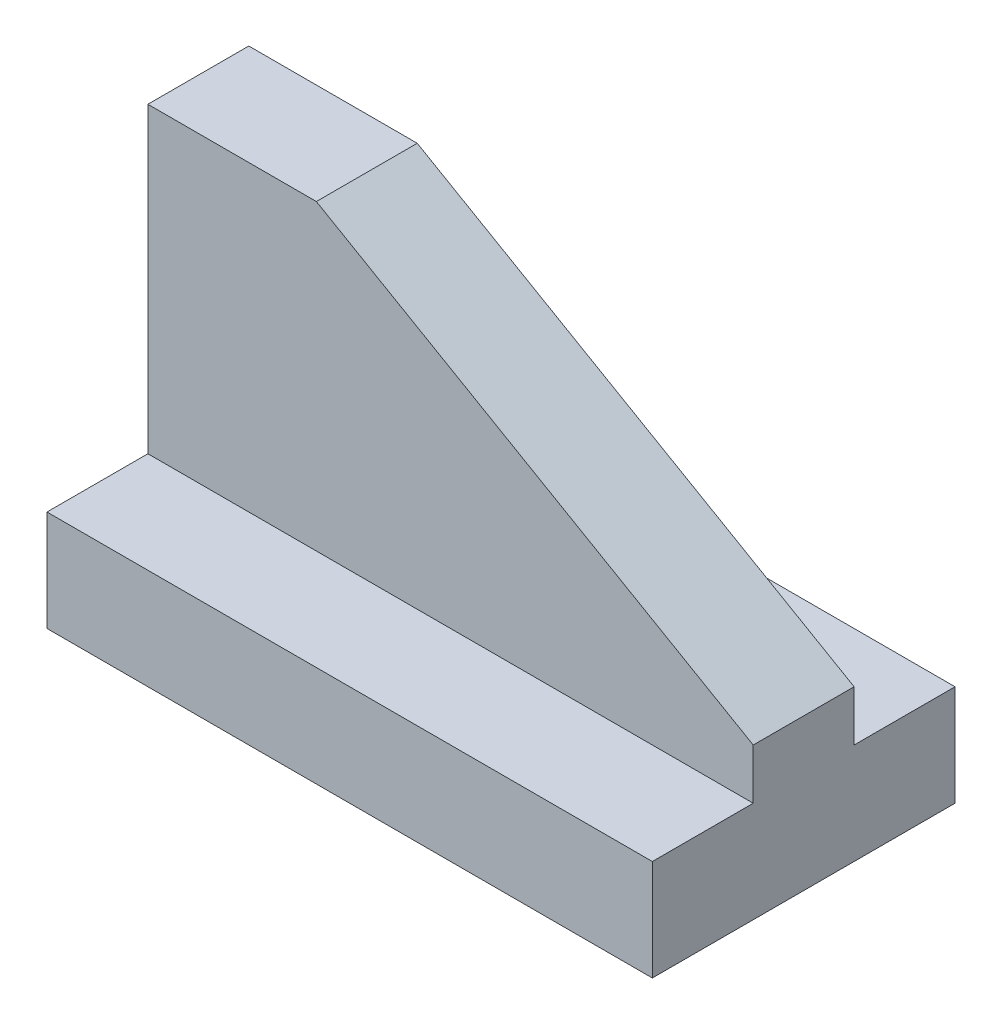
ISO-10303-21;
HEADER;
FILE_DESCRIPTION(('STEP AP214'),'2;1');
FILE_NAME('part.step','',(''),(''),'','','');
FILE_SCHEMA(('AUTOMOTIVE_DESIGN { 1 0 10303 214 1 1 1 1 }'));
ENDSEC;
DATA;
#1=APPLICATION_CONTEXT('core data for automotive mechanical design processes');
#2=APPLICATION_PROTOCOL_DEFINITION('international standard','automotive_design',2000,#1);
#3=PRODUCT_CONTEXT('',#1,'mechanical');
#4=PRODUCT('Part','Part','',(#3));
#5=PRODUCT_RELATED_PRODUCT_CATEGORY('part','',(#4));
#6=PRODUCT_DEFINITION_FORMATION('','',#4);
#7=PRODUCT_DEFINITION_CONTEXT('part definition',#1,'design');
#8=PRODUCT_DEFINITION('design','',#6,#7);
#9=PRODUCT_DEFINITION_SHAPE('','',#8);
#10=(LENGTH_UNIT() NAMED_UNIT(*) SI_UNIT(.MILLI.,.METRE.));
#11=(NAMED_UNIT(*) PLANE_ANGLE_UNIT() SI_UNIT($,.RADIAN.));
#12=(NAMED_UNIT(*) SI_UNIT($,.STERADIAN.) SOLID_ANGLE_UNIT());
#13=UNCERTAINTY_MEASURE_WITH_UNIT(LENGTH_MEASURE(1.E-05),#10,'distance_accuracy_value','');
#14=(GEOMETRIC_REPRESENTATION_CONTEXT(3) GLOBAL_UNCERTAINTY_ASSIGNED_CONTEXT((#13)) GLOBAL_UNIT_ASSIGNED_CONTEXT((#10,
#11,#12)) REPRESENTATION_CONTEXT('',''));
#15=CARTESIAN_POINT('',(0.,0.,0.));
#16=DIRECTION('',(0.,0.,1.));
#17=DIRECTION('',(1.,0.,0.));
#18=AXIS2_PLACEMENT_3D('',#15,#16,#17);
#19=CARTESIAN_POINT('',(0.,20.,60.));
#20=DIRECTION('',(0.,-1.,0.));
#21=DIRECTION('',(0.,0.,-1.));
#22=AXIS2_PLACEMENT_3D('',#19,#20,#21);
#23=PLANE('',#22);
#24=DIRECTION('',(1.,0.,0.));
#25=VECTOR('',#24,1.);
#26=CARTESIAN_POINT('',(120.,20.,40.));
#27=LINE('',#26,#25);
#28=CARTESIAN_POINT('',(0.,20.,40.));
#29=VERTEX_POINT('',#28);
#30=CARTESIAN_POINT('',(120.,20.,40.));
#31=VERTEX_POINT('',#30);
#32=EDGE_CURVE('E111',#29,#31,#27,.T.);
#33=ORIENTED_EDGE('',*,*,#32,.F.);
#34=DIRECTION('',(0.,0.,-1.));
#35=VECTOR('',#34,1.);
#36=CARTESIAN_POINT('',(0.,20.,60.));
#37=LINE('',#36,#35);
#38=CARTESIAN_POINT('',(0.,20.,60.));
#39=VERTEX_POINT('',#38);
#40=EDGE_CURVE('E193',#39,#29,#37,.T.);
#41=ORIENTED_EDGE('',*,*,#40,.F.);
#42=DIRECTION('',(-1.,0.,0.));
#43=VECTOR('',#42,1.);
#44=CARTESIAN_POINT('',(0.,20.,60.));
#45=LINE('',#44,#43);
#46=CARTESIAN_POINT('',(120.,20.,60.));
#47=VERTEX_POINT('',#46);
#48=EDGE_CURVE('E113',#47,#39,#45,.T.);
#49=ORIENTED_EDGE('',*,*,#48,.F.);
#50=DIRECTION('',(0.,0.,-1.));
#51=VECTOR('',#50,1.);
#52=CARTESIAN_POINT('',(120.,20.,60.));
#53=LINE('',#52,#51);
#54=EDGE_CURVE('E107',#47,#31,#53,.T.);
#55=ORIENTED_EDGE('',*,*,#54,.T.);
#56=EDGE_LOOP('',(#33,#41,#49,#55));
#57=FACE_BOUND('',#56,.T.);
#58=ADVANCED_FACE('F35',(#57),#23,.F.);
#59=CARTESIAN_POINT('',(0.,0.,60.));
#60=DIRECTION('',(1.,0.,0.));
#61=DIRECTION('',(0.,0.,-1.));
#62=AXIS2_PLACEMENT_3D('',#59,#60,#61);
#63=PLANE('',#62);
#64=DIRECTION('',(0.,-1.,0.));
#65=VECTOR('',#64,1.);
#66=CARTESIAN_POINT('',(0.,0.,0.));
#67=LINE('',#66,#65);
#68=CARTESIAN_POINT('',(0.,20.,0.));
#69=VERTEX_POINT('',#68);
#70=CARTESIAN_POINT('',(0.,0.,0.));
#71=VERTEX_POINT('',#70);
#72=EDGE_CURVE('E169',#69,#71,#67,.T.);
#73=ORIENTED_EDGE('',*,*,#72,.T.);
#74=DIRECTION('',(0.,0.,-1.));
#75=VECTOR('',#74,1.);
#76=CARTESIAN_POINT('',(0.,0.,60.));
#77=LINE('',#76,#75);
#78=CARTESIAN_POINT('',(0.,0.,60.));
#79=VERTEX_POINT('',#78);
#80=EDGE_CURVE('E11',#79,#71,#77,.T.);
#81=ORIENTED_EDGE('',*,*,#80,.F.);
#82=DIRECTION('',(0.,-1.,0.));
#83=VECTOR('',#82,1.);
#84=CARTESIAN_POINT('',(0.,0.,60.));
#85=LINE('',#84,#83);
#86=EDGE_CURVE('E170',#39,#79,#85,.T.);
#87=ORIENTED_EDGE('',*,*,#86,.F.);
#88=ORIENTED_EDGE('',*,*,#40,.T.);
#89=DIRECTION('',(0.,-1.,0.));
#90=VECTOR('',#89,1.);
#91=CARTESIAN_POINT('',(0.,20.,40.));
#92=LINE('',#91,#90);
#93=CARTESIAN_POINT('',(0.,80.,40.));
#94=VERTEX_POINT('',#93);
#95=EDGE_CURVE('E131',#94,#29,#92,.T.);
#96=ORIENTED_EDGE('',*,*,#95,.F.);
#97=DIRECTION('',(0.,0.,-1.));
#98=VECTOR('',#97,1.);
#99=CARTESIAN_POINT('',(0.,80.,40.));
#100=LINE('',#99,#98);
#101=CARTESIAN_POINT('',(0.,80.,20.));
#102=VERTEX_POINT('',#101);
#103=EDGE_CURVE('E164',#94,#102,#100,.T.);
#104=ORIENTED_EDGE('',*,*,#103,.T.);
#105=DIRECTION('',(0.,-1.,0.));
#106=VECTOR('',#105,1.);
#107=CARTESIAN_POINT('',(0.,20.,20.));
#108=LINE('',#107,#106);
#109=CARTESIAN_POINT('',(0.,20.,20.));
#110=VERTEX_POINT('',#109);
#111=EDGE_CURVE('E132',#102,#110,#108,.T.);
#112=ORIENTED_EDGE('',*,*,#111,.T.);
#113=EDGE_CURVE('E57',#110,#69,#37,.T.);
#114=ORIENTED_EDGE('',*,*,#113,.T.);
#115=EDGE_LOOP('',(#73,#81,#87,#88,#96,#104,#112,#114));
#116=FACE_BOUND('',#115,.T.);
#117=ADVANCED_FACE('F37',(#116),#63,.F.);
#118=CARTESIAN_POINT('',(0.,0.,60.));
#119=DIRECTION('',(0.,1.,0.));
#120=DIRECTION('',(0.,0.,1.));
#121=AXIS2_PLACEMENT_3D('',#118,#119,#120);
#122=PLANE('',#121);
#123=DIRECTION('',(1.,0.,0.));
#124=VECTOR('',#123,1.);
#125=CARTESIAN_POINT('',(0.,0.,0.));
#126=LINE('',#125,#124);
#127=CARTESIAN_POINT('',(120.,0.,0.));
#128=VERTEX_POINT('',#127);
#129=EDGE_CURVE('E181',#71,#128,#126,.T.);
#130=ORIENTED_EDGE('',*,*,#129,.T.);
#131=DIRECTION('',(0.,0.,-1.));
#132=VECTOR('',#131,1.);
#133=CARTESIAN_POINT('',(120.,0.,60.));
#134=LINE('',#133,#132);
#135=CARTESIAN_POINT('',(120.,0.,60.));
#136=VERTEX_POINT('',#135);
#137=EDGE_CURVE('E44',#136,#128,#134,.T.);
#138=ORIENTED_EDGE('',*,*,#137,.F.);
#139=DIRECTION('',(1.,0.,0.));
#140=VECTOR('',#139,1.);
#141=CARTESIAN_POINT('',(0.,0.,60.));
#142=LINE('',#141,#140);
#143=EDGE_CURVE('E173',#79,#136,#142,.T.);
#144=ORIENTED_EDGE('',*,*,#143,.F.);
#145=ORIENTED_EDGE('',*,*,#80,.T.);
#146=EDGE_LOOP('',(#130,#138,#144,#145));
#147=FACE_BOUND('',#146,.T.);
#148=ADVANCED_FACE('F226',(#147),#122,.F.);
#149=CARTESIAN_POINT('',(120.,0.,60.));
#150=DIRECTION('',(-1.,0.,0.));
#151=DIRECTION('',(0.,0.,1.));
#152=AXIS2_PLACEMENT_3D('',#149,#150,#151);
#153=PLANE('',#152);
#154=DIRECTION('',(0.,1.,0.));
#155=VECTOR('',#154,1.);
#156=CARTESIAN_POINT('',(120.,0.,0.));
#157=LINE('',#156,#155);
#158=CARTESIAN_POINT('',(120.,20.,0.));
#159=VERTEX_POINT('',#158);
#160=EDGE_CURVE('E183',#128,#159,#157,.T.);
#161=ORIENTED_EDGE('',*,*,#160,.T.);
#162=CARTESIAN_POINT('',(120.,20.,20.));
#163=VERTEX_POINT('',#162);
#164=EDGE_CURVE('E116',#163,#159,#53,.T.);
#165=ORIENTED_EDGE('',*,*,#164,.F.);
#166=DIRECTION('',(0.,1.,0.));
#167=VECTOR('',#166,1.);
#168=CARTESIAN_POINT('',(120.,30.,20.));
#169=LINE('',#168,#167);
#170=CARTESIAN_POINT('',(120.,30.,20.));
#171=VERTEX_POINT('',#170);
#172=EDGE_CURVE('E152',#163,#171,#169,.T.);
#173=ORIENTED_EDGE('',*,*,#172,.T.);
#174=DIRECTION('',(0.,0.,-1.));
#175=VECTOR('',#174,1.);
#176=CARTESIAN_POINT('',(120.,30.,40.));
#177=LINE('',#176,#175);
#178=CARTESIAN_POINT('',(120.,30.,40.));
#179=VERTEX_POINT('',#178);
#180=EDGE_CURVE('E123',#179,#171,#177,.T.);
#181=ORIENTED_EDGE('',*,*,#180,.F.);
#182=DIRECTION('',(0.,1.,0.));
#183=VECTOR('',#182,1.);
#184=CARTESIAN_POINT('',(120.,30.,40.));
#185=LINE('',#184,#183);
#186=EDGE_CURVE('E119',#31,#179,#185,.T.);
#187=ORIENTED_EDGE('',*,*,#186,.F.);
#188=ORIENTED_EDGE('',*,*,#54,.F.);
#189=DIRECTION('',(0.,1.,0.));
#190=VECTOR('',#189,1.);
#191=CARTESIAN_POINT('',(120.,0.,60.));
#192=LINE('',#191,#190);
#193=EDGE_CURVE('E176',#136,#47,#192,.T.);
#194=ORIENTED_EDGE('',*,*,#193,.F.);
#195=ORIENTED_EDGE('',*,*,#137,.T.);
#196=EDGE_LOOP('',(#161,#165,#173,#181,#187,#188,#194,#195));
#197=FACE_BOUND('',#196,.T.);
#198=ADVANCED_FACE('F121',(#197),#153,.F.);
#199=ORIENTED_EDGE('',*,*,#113,.F.);
#200=DIRECTION('',(1.,0.,0.));
#201=VECTOR('',#200,1.);
#202=CARTESIAN_POINT('',(120.,20.,20.));
#203=LINE('',#202,#201);
#204=EDGE_CURVE('E52',#110,#163,#203,.T.);
#205=ORIENTED_EDGE('',*,*,#204,.T.);
#206=ORIENTED_EDGE('',*,*,#164,.T.);
#207=DIRECTION('',(-1.,0.,0.));
#208=VECTOR('',#207,1.);
#209=CARTESIAN_POINT('',(0.,20.,0.));
#210=LINE('',#209,#208);
#211=EDGE_CURVE('E174',#159,#69,#210,.T.);
#212=ORIENTED_EDGE('',*,*,#211,.T.);
#213=EDGE_LOOP('',(#199,#205,#206,#212));
#214=FACE_BOUND('',#213,.T.);
#215=ADVANCED_FACE('F202',(#214),#23,.F.);
#216=CARTESIAN_POINT('',(0.,0.,60.));
#217=DIRECTION('',(0.,0.,-1.));
#218=DIRECTION('',(-1.,0.,0.));
#219=AXIS2_PLACEMENT_3D('',#216,#217,#218);
#220=PLANE('',#219);
#221=ORIENTED_EDGE('',*,*,#86,.T.);
#222=ORIENTED_EDGE('',*,*,#143,.T.);
#223=ORIENTED_EDGE('',*,*,#193,.T.);
#224=ORIENTED_EDGE('',*,*,#48,.T.);
#225=EDGE_LOOP('',(#221,#222,#223,#224));
#226=FACE_BOUND('',#225,.T.);
#227=ADVANCED_FACE('F218',(#226),#220,.F.);
#228=CARTESIAN_POINT('',(0.,0.,0.));
#229=DIRECTION('',(0.,0.,-1.));
#230=DIRECTION('',(-1.,0.,0.));
#231=AXIS2_PLACEMENT_3D('',#228,#229,#230);
#232=PLANE('',#231);
#233=ORIENTED_EDGE('',*,*,#72,.F.);
#234=ORIENTED_EDGE('',*,*,#211,.F.);
#235=ORIENTED_EDGE('',*,*,#160,.F.);
#236=ORIENTED_EDGE('',*,*,#129,.F.);
#237=EDGE_LOOP('',(#233,#234,#235,#236));
#238=FACE_BOUND('',#237,.T.);
#239=ADVANCED_FACE('F201',(#238),#232,.T.);
#240=CARTESIAN_POINT('',(33.3974596215556,80.,40.));
#241=DIRECTION('',(-0.499999999999998,-0.86602540378444,0.));
#242=DIRECTION('',(0.86602540378444,-0.499999999999998,0.));
#243=AXIS2_PLACEMENT_3D('',#240,#241,#242);
#244=PLANE('',#243);
#245=DIRECTION('',(-0.86602540378444,0.499999999999998,0.));
#246=VECTOR('',#245,1.);
#247=CARTESIAN_POINT('',(33.3974596215556,80.,20.));
#248=LINE('',#247,#246);
#249=CARTESIAN_POINT('',(33.3974596215556,80.,20.));
#250=VERTEX_POINT('',#249);
#251=EDGE_CURVE('E148',#171,#250,#248,.T.);
#252=ORIENTED_EDGE('',*,*,#251,.T.);
#253=DIRECTION('',(0.,0.,-1.));
#254=VECTOR('',#253,1.);
#255=CARTESIAN_POINT('',(33.3974596215556,80.,40.));
#256=LINE('',#255,#254);
#257=CARTESIAN_POINT('',(33.3974596215556,80.,40.));
#258=VERTEX_POINT('',#257);
#259=EDGE_CURVE('E166',#258,#250,#256,.T.);
#260=ORIENTED_EDGE('',*,*,#259,.F.);
#261=DIRECTION('',(-0.86602540378444,0.499999999999998,0.));
#262=VECTOR('',#261,1.);
#263=CARTESIAN_POINT('',(33.3974596215556,80.,40.));
#264=LINE('',#263,#262);
#265=EDGE_CURVE('E126',#179,#258,#264,.T.);
#266=ORIENTED_EDGE('',*,*,#265,.F.);
#267=ORIENTED_EDGE('',*,*,#180,.T.);
#268=EDGE_LOOP('',(#252,#260,#266,#267));
#269=FACE_BOUND('',#268,.T.);
#270=ADVANCED_FACE('F210',(#269),#244,.F.);
#271=CARTESIAN_POINT('',(0.,80.,40.));
#272=DIRECTION('',(0.,-1.,0.));
#273=DIRECTION('',(0.,0.,-1.));
#274=AXIS2_PLACEMENT_3D('',#271,#272,#273);
#275=PLANE('',#274);
#276=DIRECTION('',(-1.,0.,0.));
#277=VECTOR('',#276,1.);
#278=CARTESIAN_POINT('',(0.,80.,20.));
#279=LINE('',#278,#277);
#280=EDGE_CURVE('E134',#250,#102,#279,.T.);
#281=ORIENTED_EDGE('',*,*,#280,.T.);
#282=ORIENTED_EDGE('',*,*,#103,.F.);
#283=DIRECTION('',(-1.,0.,0.));
#284=VECTOR('',#283,1.);
#285=CARTESIAN_POINT('',(0.,80.,40.));
#286=LINE('',#285,#284);
#287=EDGE_CURVE('E144',#258,#94,#286,.T.);
#288=ORIENTED_EDGE('',*,*,#287,.F.);
#289=ORIENTED_EDGE('',*,*,#259,.T.);
#290=EDGE_LOOP('',(#281,#282,#288,#289));
#291=FACE_BOUND('',#290,.T.);
#292=ADVANCED_FACE('F209',(#291),#275,.F.);
#293=CARTESIAN_POINT('',(0.,0.,40.));
#294=DIRECTION('',(0.,0.,-1.));
#295=DIRECTION('',(-1.,0.,0.));
#296=AXIS2_PLACEMENT_3D('',#293,#294,#295);
#297=PLANE('',#296);
#298=ORIENTED_EDGE('',*,*,#32,.T.);
#299=ORIENTED_EDGE('',*,*,#186,.T.);
#300=ORIENTED_EDGE('',*,*,#265,.T.);
#301=ORIENTED_EDGE('',*,*,#287,.T.);
#302=ORIENTED_EDGE('',*,*,#95,.T.);
#303=EDGE_LOOP('',(#298,#299,#300,#301,#302));
#304=FACE_BOUND('',#303,.T.);
#305=ADVANCED_FACE('F129',(#304),#297,.F.);
#306=CARTESIAN_POINT('',(0.,0.,20.));
#307=DIRECTION('',(0.,0.,-1.));
#308=DIRECTION('',(-1.,0.,0.));
#309=AXIS2_PLACEMENT_3D('',#306,#307,#308);
#310=PLANE('',#309);
#311=ORIENTED_EDGE('',*,*,#204,.F.);
#312=ORIENTED_EDGE('',*,*,#111,.F.);
#313=ORIENTED_EDGE('',*,*,#280,.F.);
#314=ORIENTED_EDGE('',*,*,#251,.F.);
#315=ORIENTED_EDGE('',*,*,#172,.F.);
#316=EDGE_LOOP('',(#311,#312,#313,#314,#315));
#317=FACE_BOUND('',#316,.T.);
#318=ADVANCED_FACE('F205',(#317),#310,.T.);
#319=CLOSED_SHELL('',(#58,#117,#148,#198,#215,#227,#239,#270,#292,#305,#318));
#320=MANIFOLD_SOLID_BREP('B2',#319);
#321=ADVANCED_BREP_SHAPE_REPRESENTATION('',(#18,#320),#14);
#322=SHAPE_DEFINITION_REPRESENTATION(#9,#321);
ENDSEC;
END-ISO-10303-21;
